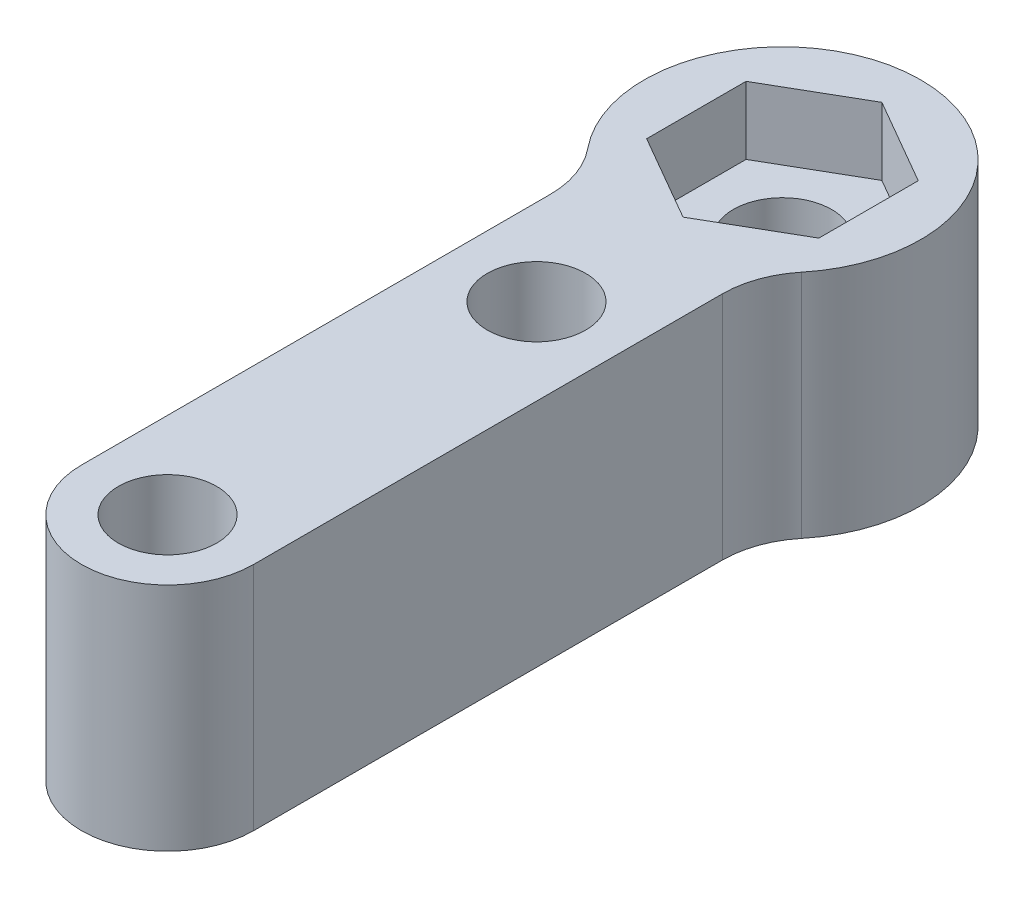
ISO-10303-21;
HEADER;
FILE_DESCRIPTION(('STEP AP214'),'2;1');
FILE_NAME('part.step','',(''),(''),'','','');
FILE_SCHEMA(('AUTOMOTIVE_DESIGN { 1 0 10303 214 1 1 1 1 }'));
ENDSEC;
DATA;
#1=APPLICATION_CONTEXT('core data for automotive mechanical design processes');
#2=APPLICATION_PROTOCOL_DEFINITION('international standard','automotive_design',2000,#1);
#3=PRODUCT_CONTEXT('',#1,'mechanical');
#4=PRODUCT('Part','Part','',(#3));
#5=PRODUCT_RELATED_PRODUCT_CATEGORY('part','',(#4));
#6=PRODUCT_DEFINITION_FORMATION('','',#4);
#7=PRODUCT_DEFINITION_CONTEXT('part definition',#1,'design');
#8=PRODUCT_DEFINITION('design','',#6,#7);
#9=PRODUCT_DEFINITION_SHAPE('','',#8);
#10=(LENGTH_UNIT() NAMED_UNIT(*) SI_UNIT(.MILLI.,.METRE.));
#11=(NAMED_UNIT(*) PLANE_ANGLE_UNIT() SI_UNIT($,.RADIAN.));
#12=(NAMED_UNIT(*) SI_UNIT($,.STERADIAN.) SOLID_ANGLE_UNIT());
#13=UNCERTAINTY_MEASURE_WITH_UNIT(LENGTH_MEASURE(1.E-05),#10,'distance_accuracy_value','');
#14=(GEOMETRIC_REPRESENTATION_CONTEXT(3) GLOBAL_UNCERTAINTY_ASSIGNED_CONTEXT((#13)) GLOBAL_UNIT_ASSIGNED_CONTEXT((#10,
#11,#12)) REPRESENTATION_CONTEXT('',''));
#15=CARTESIAN_POINT('',(0.,0.,0.));
#16=DIRECTION('',(0.,0.,1.));
#17=DIRECTION('',(1.,0.,0.));
#18=AXIS2_PLACEMENT_3D('',#15,#16,#17);
#19=CARTESIAN_POINT('',(0.,7.5,-20.));
#20=DIRECTION('',(0.,-1.,0.));
#21=DIRECTION('',(0.,0.,-1.));
#22=AXIS2_PLACEMENT_3D('',#19,#20,#21);
#23=CYLINDRICAL_SURFACE('',#22,1.6);
#24=CARTESIAN_POINT('',(0.,0.,-20.));
#25=DIRECTION('',(0.,1.,0.));
#26=DIRECTION('',(0.,0.,1.));
#27=AXIS2_PLACEMENT_3D('',#24,#25,#26);
#28=CIRCLE('',#27,1.6);
#29=CARTESIAN_POINT('',(0.,0.,-18.4));
#30=VERTEX_POINT('',#29);
#31=EDGE_CURVE('E178',#30,#30,#28,.T.);
#32=ORIENTED_EDGE('',*,*,#31,.F.);
#33=EDGE_LOOP('',(#32));
#34=FACE_BOUND('',#33,.T.);
#35=CARTESIAN_POINT('',(0.,5.3,-20.));
#36=DIRECTION('',(0.,1.,0.));
#37=DIRECTION('',(0.,0.,1.));
#38=AXIS2_PLACEMENT_3D('',#35,#36,#37);
#39=CIRCLE('',#38,1.6);
#40=CARTESIAN_POINT('',(0.,5.3,-18.4));
#41=VERTEX_POINT('',#40);
#42=EDGE_CURVE('E170',#41,#41,#39,.T.);
#43=ORIENTED_EDGE('',*,*,#42,.T.);
#44=EDGE_LOOP('',(#43));
#45=FACE_BOUND('',#44,.T.);
#46=ADVANCED_FACE('F32',(#34,#45),#23,.F.);
#47=CARTESIAN_POINT('',(0.,7.5,0.));
#48=DIRECTION('',(0.,1.,0.));
#49=DIRECTION('',(0.,0.,1.));
#50=AXIS2_PLACEMENT_3D('',#47,#48,#49);
#51=PLANE('',#50);
#52=DIRECTION('',(-0.866025403784439,0.,-0.5));
#53=VECTOR('',#52,1.);
#54=CARTESIAN_POINT('',(2.8,7.5,-21.616580753731));
#55=LINE('',#54,#53);
#56=CARTESIAN_POINT('',(2.8,7.5,-21.616580753731));
#57=VERTEX_POINT('',#56);
#58=CARTESIAN_POINT('',(0.,7.5,-23.2331615074619));
#59=VERTEX_POINT('',#58);
#60=EDGE_CURVE('E126',#57,#59,#55,.T.);
#61=ORIENTED_EDGE('',*,*,#60,.F.);
#62=DIRECTION('',(0.,0.,-1.));
#63=VECTOR('',#62,1.);
#64=CARTESIAN_POINT('',(2.8,7.5,-18.3834192462691));
#65=LINE('',#64,#63);
#66=CARTESIAN_POINT('',(2.8,7.5,-18.3834192462691));
#67=VERTEX_POINT('',#66);
#68=EDGE_CURVE('E144',#67,#57,#65,.T.);
#69=ORIENTED_EDGE('',*,*,#68,.F.);
#70=DIRECTION('',(0.866025403784438,0.,-0.5));
#71=VECTOR('',#70,1.);
#72=CARTESIAN_POINT('',(0.,7.5,-16.7668384925381));
#73=LINE('',#72,#71);
#74=CARTESIAN_POINT('',(0.,7.5,-16.7668384925381));
#75=VERTEX_POINT('',#74);
#76=EDGE_CURVE('E147',#75,#67,#73,.T.);
#77=ORIENTED_EDGE('',*,*,#76,.F.);
#78=DIRECTION('',(0.866025403784438,0.,0.500000000000001));
#79=VECTOR('',#78,1.);
#80=CARTESIAN_POINT('',(-2.8,7.5,-18.3834192462691));
#81=LINE('',#80,#79);
#82=CARTESIAN_POINT('',(-2.8,7.5,-18.3834192462691));
#83=VERTEX_POINT('',#82);
#84=EDGE_CURVE('E163',#83,#75,#81,.T.);
#85=ORIENTED_EDGE('',*,*,#84,.F.);
#86=DIRECTION('',(0.,0.,1.));
#87=VECTOR('',#86,1.);
#88=CARTESIAN_POINT('',(-2.8,7.5,-21.616580753731));
#89=LINE('',#88,#87);
#90=CARTESIAN_POINT('',(-2.8,7.5,-21.616580753731));
#91=VERTEX_POINT('',#90);
#92=EDGE_CURVE('E160',#91,#83,#89,.T.);
#93=ORIENTED_EDGE('',*,*,#92,.F.);
#94=DIRECTION('',(-0.866025403784439,0.,0.5));
#95=VECTOR('',#94,1.);
#96=CARTESIAN_POINT('',(0.,7.5,-23.2331615074619));
#97=LINE('',#96,#95);
#98=EDGE_CURVE('E158',#59,#91,#97,.T.);
#99=ORIENTED_EDGE('',*,*,#98,.F.);
#100=EDGE_LOOP('',(#61,#69,#77,#85,#93,#99));
#101=FACE_BOUND('',#100,.T.);
#102=CARTESIAN_POINT('',(0.,7.5,-12.));
#103=DIRECTION('',(0.,1.,0.));
#104=DIRECTION('',(0.,0.,1.));
#105=AXIS2_PLACEMENT_3D('',#102,#103,#104);
#106=CIRCLE('',#105,1.6);
#107=CARTESIAN_POINT('',(0.,7.5,-10.4));
#108=VERTEX_POINT('',#107);
#109=EDGE_CURVE('E182',#108,#108,#106,.T.);
#110=ORIENTED_EDGE('',*,*,#109,.F.);
#111=EDGE_LOOP('',(#110));
#112=FACE_BOUND('',#111,.T.);
#113=CARTESIAN_POINT('',(0.,7.5,0.));
#114=DIRECTION('',(0.,1.,0.));
#115=DIRECTION('',(0.,0.,1.));
#116=AXIS2_PLACEMENT_3D('',#113,#114,#115);
#117=CIRCLE('',#116,2.8);
#118=CARTESIAN_POINT('',(-2.8,7.5,0.));
#119=VERTEX_POINT('',#118);
#120=CARTESIAN_POINT('',(2.8,7.5,0.));
#121=VERTEX_POINT('',#120);
#122=EDGE_CURVE('E194',#119,#121,#117,.T.);
#123=ORIENTED_EDGE('',*,*,#122,.T.);
#124=DIRECTION('',(0.,0.,-1.));
#125=VECTOR('',#124,1.);
#126=CARTESIAN_POINT('',(2.8,7.5,0.));
#127=LINE('',#126,#125);
#128=CARTESIAN_POINT('',(2.8,7.5,-15.2450026288125));
#129=VERTEX_POINT('',#128);
#130=EDGE_CURVE('E197',#121,#129,#127,.T.);
#131=ORIENTED_EDGE('',*,*,#130,.T.);
#132=CARTESIAN_POINT('',(5.8,7.5,-15.2450026288125));
#133=DIRECTION('',(0.,1.,0.));
#134=DIRECTION('',(0.,0.,1.));
#135=AXIS2_PLACEMENT_3D('',#132,#133,#134);
#136=CIRCLE('',#135,3.);
#137=CARTESIAN_POINT('',(3.48,7.5,-17.1470015772875));
#138=VERTEX_POINT('',#137);
#139=EDGE_CURVE('E11',#129,#138,#136,.F.);
#140=ORIENTED_EDGE('',*,*,#139,.T.);
#141=CARTESIAN_POINT('',(0.,7.5,-20.));
#142=DIRECTION('',(0.,1.,0.));
#143=DIRECTION('',(0.,0.,1.));
#144=AXIS2_PLACEMENT_3D('',#141,#142,#143);
#145=CIRCLE('',#144,4.5);
#146=CARTESIAN_POINT('',(-3.48,7.5,-17.1470015772875));
#147=VERTEX_POINT('',#146);
#148=EDGE_CURVE('E200',#138,#147,#145,.T.);
#149=ORIENTED_EDGE('',*,*,#148,.T.);
#150=CARTESIAN_POINT('',(-5.8,7.5,-15.2450026288125));
#151=DIRECTION('',(0.,1.,0.));
#152=DIRECTION('',(0.,0.,1.));
#153=AXIS2_PLACEMENT_3D('',#150,#151,#152);
#154=CIRCLE('',#153,3.);
#155=CARTESIAN_POINT('',(-2.8,7.5,-15.2450026288125));
#156=VERTEX_POINT('',#155);
#157=EDGE_CURVE('E232',#147,#156,#154,.F.);
#158=ORIENTED_EDGE('',*,*,#157,.T.);
#159=DIRECTION('',(0.,0.,1.));
#160=VECTOR('',#159,1.);
#161=CARTESIAN_POINT('',(-2.8,7.5,0.));
#162=LINE('',#161,#160);
#163=EDGE_CURVE('E203',#156,#119,#162,.T.);
#164=ORIENTED_EDGE('',*,*,#163,.T.);
#165=EDGE_LOOP('',(#123,#131,#140,#149,#158,#164));
#166=FACE_BOUND('',#165,.T.);
#167=CARTESIAN_POINT('',(0.,7.5,0.));
#168=DIRECTION('',(0.,1.,0.));
#169=DIRECTION('',(0.,0.,1.));
#170=AXIS2_PLACEMENT_3D('',#167,#168,#169);
#171=CIRCLE('',#170,1.6);
#172=CARTESIAN_POINT('',(0.,7.5,1.6));
#173=VERTEX_POINT('',#172);
#174=EDGE_CURVE('E188',#173,#173,#171,.T.);
#175=ORIENTED_EDGE('',*,*,#174,.F.);
#176=EDGE_LOOP('',(#175));
#177=FACE_BOUND('',#176,.T.);
#178=ADVANCED_FACE('F236',(#101,#112,#166,#177),#51,.T.);
#179=CARTESIAN_POINT('',(0.,0.,0.));
#180=DIRECTION('',(0.,1.,0.));
#181=DIRECTION('',(0.,0.,1.));
#182=AXIS2_PLACEMENT_3D('',#179,#180,#181);
#183=PLANE('',#182);
#184=CARTESIAN_POINT('',(0.,0.,-12.));
#185=DIRECTION('',(0.,1.,0.));
#186=DIRECTION('',(0.,0.,1.));
#187=AXIS2_PLACEMENT_3D('',#184,#185,#186);
#188=CIRCLE('',#187,1.6);
#189=CARTESIAN_POINT('',(0.,0.,-10.4));
#190=VERTEX_POINT('',#189);
#191=EDGE_CURVE('E181',#190,#190,#188,.T.);
#192=ORIENTED_EDGE('',*,*,#191,.T.);
#193=EDGE_LOOP('',(#192));
#194=FACE_BOUND('',#193,.T.);
#195=CARTESIAN_POINT('',(0.,0.,0.));
#196=DIRECTION('',(0.,1.,0.));
#197=DIRECTION('',(0.,0.,1.));
#198=AXIS2_PLACEMENT_3D('',#195,#196,#197);
#199=CIRCLE('',#198,2.8);
#200=CARTESIAN_POINT('',(-2.8,0.,0.));
#201=VERTEX_POINT('',#200);
#202=CARTESIAN_POINT('',(2.8,0.,0.));
#203=VERTEX_POINT('',#202);
#204=EDGE_CURVE('E191',#201,#203,#199,.T.);
#205=ORIENTED_EDGE('',*,*,#204,.F.);
#206=DIRECTION('',(0.,0.,1.));
#207=VECTOR('',#206,1.);
#208=CARTESIAN_POINT('',(-2.8,0.,0.));
#209=LINE('',#208,#207);
#210=CARTESIAN_POINT('',(-2.8,0.,-15.2450026288125));
#211=VERTEX_POINT('',#210);
#212=EDGE_CURVE('E198',#211,#201,#209,.T.);
#213=ORIENTED_EDGE('',*,*,#212,.F.);
#214=CARTESIAN_POINT('',(-5.8,0.,-15.2450026288125));
#215=DIRECTION('',(0.,1.,0.));
#216=DIRECTION('',(0.,0.,1.));
#217=AXIS2_PLACEMENT_3D('',#214,#215,#216);
#218=CIRCLE('',#217,3.);
#219=CARTESIAN_POINT('',(-3.48,0.,-17.1470015772875));
#220=VERTEX_POINT('',#219);
#221=EDGE_CURVE('E230',#211,#220,#218,.T.);
#222=ORIENTED_EDGE('',*,*,#221,.T.);
#223=CARTESIAN_POINT('',(0.,0.,-20.));
#224=DIRECTION('',(0.,1.,0.));
#225=DIRECTION('',(0.,0.,1.));
#226=AXIS2_PLACEMENT_3D('',#223,#224,#225);
#227=CIRCLE('',#226,4.5);
#228=CARTESIAN_POINT('',(3.48,0.,-17.1470015772875));
#229=VERTEX_POINT('',#228);
#230=EDGE_CURVE('E210',#229,#220,#227,.T.);
#231=ORIENTED_EDGE('',*,*,#230,.F.);
#232=CARTESIAN_POINT('',(5.8,0.,-15.2450026288125));
#233=DIRECTION('',(0.,1.,0.));
#234=DIRECTION('',(0.,0.,1.));
#235=AXIS2_PLACEMENT_3D('',#232,#233,#234);
#236=CIRCLE('',#235,3.);
#237=CARTESIAN_POINT('',(2.8,0.,-15.2450026288125));
#238=VERTEX_POINT('',#237);
#239=EDGE_CURVE('E40',#229,#238,#236,.T.);
#240=ORIENTED_EDGE('',*,*,#239,.T.);
#241=DIRECTION('',(0.,0.,-1.));
#242=VECTOR('',#241,1.);
#243=CARTESIAN_POINT('',(2.8,0.,0.));
#244=LINE('',#243,#242);
#245=EDGE_CURVE('E208',#203,#238,#244,.T.);
#246=ORIENTED_EDGE('',*,*,#245,.F.);
#247=EDGE_LOOP('',(#205,#213,#222,#231,#240,#246));
#248=FACE_BOUND('',#247,.T.);
#249=CARTESIAN_POINT('',(0.,0.,0.));
#250=DIRECTION('',(0.,1.,0.));
#251=DIRECTION('',(0.,0.,1.));
#252=AXIS2_PLACEMENT_3D('',#249,#250,#251);
#253=CIRCLE('',#252,1.6);
#254=CARTESIAN_POINT('',(0.,0.,1.6));
#255=VERTEX_POINT('',#254);
#256=EDGE_CURVE('E185',#255,#255,#253,.T.);
#257=ORIENTED_EDGE('',*,*,#256,.T.);
#258=EDGE_LOOP('',(#257));
#259=FACE_BOUND('',#258,.T.);
#260=ORIENTED_EDGE('',*,*,#31,.T.);
#261=EDGE_LOOP('',(#260));
#262=FACE_BOUND('',#261,.T.);
#263=ADVANCED_FACE('F249',(#194,#248,#259,#262),#183,.F.);
#264=CARTESIAN_POINT('',(0.,7.5,0.));
#265=DIRECTION('',(0.,-1.,0.));
#266=DIRECTION('',(0.,0.,-1.));
#267=AXIS2_PLACEMENT_3D('',#264,#265,#266);
#268=CYLINDRICAL_SURFACE('',#267,2.8);
#269=ORIENTED_EDGE('',*,*,#204,.T.);
#270=DIRECTION('',(0.,-1.,0.));
#271=VECTOR('',#270,1.);
#272=CARTESIAN_POINT('',(2.8,7.5,0.));
#273=LINE('',#272,#271);
#274=EDGE_CURVE('E216',#121,#203,#273,.T.);
#275=ORIENTED_EDGE('',*,*,#274,.F.);
#276=ORIENTED_EDGE('',*,*,#122,.F.);
#277=DIRECTION('',(0.,-1.,0.));
#278=VECTOR('',#277,1.);
#279=CARTESIAN_POINT('',(-2.8,7.5,0.));
#280=LINE('',#279,#278);
#281=EDGE_CURVE('E205',#119,#201,#280,.T.);
#282=ORIENTED_EDGE('',*,*,#281,.T.);
#283=EDGE_LOOP('',(#269,#275,#276,#282));
#284=FACE_BOUND('',#283,.T.);
#285=ADVANCED_FACE('F259',(#284),#268,.T.);
#286=CARTESIAN_POINT('',(2.8,7.5,0.));
#287=DIRECTION('',(-1.,0.,0.));
#288=DIRECTION('',(0.,0.,1.));
#289=AXIS2_PLACEMENT_3D('',#286,#287,#288);
#290=PLANE('',#289);
#291=ORIENTED_EDGE('',*,*,#245,.T.);
#292=DIRECTION('',(0.,1.,0.));
#293=VECTOR('',#292,1.);
#294=CARTESIAN_POINT('',(2.8,7.5,-15.2450026288125));
#295=LINE('',#294,#293);
#296=EDGE_CURVE('E47',#238,#129,#295,.T.);
#297=ORIENTED_EDGE('',*,*,#296,.T.);
#298=ORIENTED_EDGE('',*,*,#130,.F.);
#299=ORIENTED_EDGE('',*,*,#274,.T.);
#300=EDGE_LOOP('',(#291,#297,#298,#299));
#301=FACE_BOUND('',#300,.T.);
#302=ADVANCED_FACE('F257',(#301),#290,.F.);
#303=CARTESIAN_POINT('',(0.,7.5,-20.));
#304=DIRECTION('',(0.,-1.,0.));
#305=DIRECTION('',(0.,0.,-1.));
#306=AXIS2_PLACEMENT_3D('',#303,#304,#305);
#307=CYLINDRICAL_SURFACE('',#306,4.5);
#308=ORIENTED_EDGE('',*,*,#230,.T.);
#309=DIRECTION('',(0.,-1.,0.));
#310=VECTOR('',#309,1.);
#311=CARTESIAN_POINT('',(-3.48,7.5,-17.1470015772875));
#312=LINE('',#311,#310);
#313=EDGE_CURVE('E227',#220,#147,#312,.F.);
#314=ORIENTED_EDGE('',*,*,#313,.T.);
#315=ORIENTED_EDGE('',*,*,#148,.F.);
#316=DIRECTION('',(0.,-1.,0.));
#317=VECTOR('',#316,1.);
#318=CARTESIAN_POINT('',(3.48,7.5,-17.1470015772875));
#319=LINE('',#318,#317);
#320=EDGE_CURVE('E224',#138,#229,#319,.T.);
#321=ORIENTED_EDGE('',*,*,#320,.T.);
#322=EDGE_LOOP('',(#308,#314,#315,#321));
#323=FACE_BOUND('',#322,.T.);
#324=ADVANCED_FACE('F252',(#323),#307,.T.);
#325=CARTESIAN_POINT('',(-2.8,7.5,0.));
#326=DIRECTION('',(1.,0.,0.));
#327=DIRECTION('',(0.,0.,-1.));
#328=AXIS2_PLACEMENT_3D('',#325,#326,#327);
#329=PLANE('',#328);
#330=ORIENTED_EDGE('',*,*,#163,.F.);
#331=DIRECTION('',(0.,1.,0.));
#332=VECTOR('',#331,1.);
#333=CARTESIAN_POINT('',(-2.8,0.,-15.2450026288125));
#334=LINE('',#333,#332);
#335=EDGE_CURVE('E219',#156,#211,#334,.F.);
#336=ORIENTED_EDGE('',*,*,#335,.T.);
#337=ORIENTED_EDGE('',*,*,#212,.T.);
#338=ORIENTED_EDGE('',*,*,#281,.F.);
#339=EDGE_LOOP('',(#330,#336,#337,#338));
#340=FACE_BOUND('',#339,.T.);
#341=ADVANCED_FACE('F244',(#340),#329,.F.);
#342=CARTESIAN_POINT('',(0.,7.5,0.));
#343=DIRECTION('',(0.,-1.,0.));
#344=DIRECTION('',(0.,0.,-1.));
#345=AXIS2_PLACEMENT_3D('',#342,#343,#344);
#346=CYLINDRICAL_SURFACE('',#345,1.6);
#347=ORIENTED_EDGE('',*,*,#174,.T.);
#348=EDGE_LOOP('',(#347));
#349=FACE_BOUND('',#348,.T.);
#350=ORIENTED_EDGE('',*,*,#256,.F.);
#351=EDGE_LOOP('',(#350));
#352=FACE_BOUND('',#351,.T.);
#353=ADVANCED_FACE('F285',(#349,#352),#346,.F.);
#354=CARTESIAN_POINT('',(0.,7.5,-12.));
#355=DIRECTION('',(0.,-1.,0.));
#356=DIRECTION('',(0.,0.,-1.));
#357=AXIS2_PLACEMENT_3D('',#354,#355,#356);
#358=CYLINDRICAL_SURFACE('',#357,1.6);
#359=ORIENTED_EDGE('',*,*,#109,.T.);
#360=EDGE_LOOP('',(#359));
#361=FACE_BOUND('',#360,.T.);
#362=ORIENTED_EDGE('',*,*,#191,.F.);
#363=EDGE_LOOP('',(#362));
#364=FACE_BOUND('',#363,.T.);
#365=ADVANCED_FACE('F282',(#361,#364),#358,.F.);
#366=CARTESIAN_POINT('',(2.8,5.3,-21.616580753731));
#367=DIRECTION('',(0.5,0.,-0.866025403784439));
#368=DIRECTION('',(-0.866025403784439,0.,-0.5));
#369=AXIS2_PLACEMENT_3D('',#366,#367,#368);
#370=PLANE('',#369);
#371=ORIENTED_EDGE('',*,*,#60,.T.);
#372=DIRECTION('',(0.,1.,0.));
#373=VECTOR('',#372,1.);
#374=CARTESIAN_POINT('',(0.,5.3,-23.2331615074619));
#375=LINE('',#374,#373);
#376=CARTESIAN_POINT('',(0.,5.3,-23.2331615074619));
#377=VERTEX_POINT('',#376);
#378=EDGE_CURVE('E119',#377,#59,#375,.T.);
#379=ORIENTED_EDGE('',*,*,#378,.F.);
#380=DIRECTION('',(-0.866025403784439,0.,-0.5));
#381=VECTOR('',#380,1.);
#382=CARTESIAN_POINT('',(2.8,5.3,-21.616580753731));
#383=LINE('',#382,#381);
#384=CARTESIAN_POINT('',(2.8,5.3,-21.616580753731));
#385=VERTEX_POINT('',#384);
#386=EDGE_CURVE('E123',#385,#377,#383,.T.);
#387=ORIENTED_EDGE('',*,*,#386,.F.);
#388=DIRECTION('',(0.,1.,0.));
#389=VECTOR('',#388,1.);
#390=CARTESIAN_POINT('',(2.8,5.3,-21.616580753731));
#391=LINE('',#390,#389);
#392=EDGE_CURVE('E168',#385,#57,#391,.T.);
#393=ORIENTED_EDGE('',*,*,#392,.T.);
#394=EDGE_LOOP('',(#371,#379,#387,#393));
#395=FACE_BOUND('',#394,.T.);
#396=ADVANCED_FACE('F121',(#395),#370,.F.);
#397=CARTESIAN_POINT('',(2.8,5.3,-18.3834192462691));
#398=DIRECTION('',(1.,0.,0.));
#399=DIRECTION('',(0.,0.,-1.));
#400=AXIS2_PLACEMENT_3D('',#397,#398,#399);
#401=PLANE('',#400);
#402=ORIENTED_EDGE('',*,*,#68,.T.);
#403=ORIENTED_EDGE('',*,*,#392,.F.);
#404=DIRECTION('',(0.,0.,-1.));
#405=VECTOR('',#404,1.);
#406=CARTESIAN_POINT('',(2.8,5.3,-18.3834192462691));
#407=LINE('',#406,#405);
#408=CARTESIAN_POINT('',(2.8,5.3,-18.3834192462691));
#409=VERTEX_POINT('',#408);
#410=EDGE_CURVE('E131',#409,#385,#407,.T.);
#411=ORIENTED_EDGE('',*,*,#410,.F.);
#412=DIRECTION('',(0.,1.,0.));
#413=VECTOR('',#412,1.);
#414=CARTESIAN_POINT('',(2.8,5.3,-18.3834192462691));
#415=LINE('',#414,#413);
#416=EDGE_CURVE('E171',#409,#67,#415,.T.);
#417=ORIENTED_EDGE('',*,*,#416,.T.);
#418=EDGE_LOOP('',(#402,#403,#411,#417));
#419=FACE_BOUND('',#418,.T.);
#420=ADVANCED_FACE('F316',(#419),#401,.F.);
#421=CARTESIAN_POINT('',(0.,5.3,-16.7668384925381));
#422=DIRECTION('',(0.5,0.,0.866025403784439));
#423=DIRECTION('',(0.866025403784438,0.,-0.5));
#424=AXIS2_PLACEMENT_3D('',#421,#422,#423);
#425=PLANE('',#424);
#426=ORIENTED_EDGE('',*,*,#76,.T.);
#427=ORIENTED_EDGE('',*,*,#416,.F.);
#428=DIRECTION('',(0.866025403784438,0.,-0.5));
#429=VECTOR('',#428,1.);
#430=CARTESIAN_POINT('',(0.,5.3,-16.7668384925381));
#431=LINE('',#430,#429);
#432=CARTESIAN_POINT('',(0.,5.3,-16.7668384925381));
#433=VERTEX_POINT('',#432);
#434=EDGE_CURVE('E154',#433,#409,#431,.T.);
#435=ORIENTED_EDGE('',*,*,#434,.F.);
#436=DIRECTION('',(0.,1.,0.));
#437=VECTOR('',#436,1.);
#438=CARTESIAN_POINT('',(0.,5.3,-16.7668384925381));
#439=LINE('',#438,#437);
#440=EDGE_CURVE('E173',#433,#75,#439,.T.);
#441=ORIENTED_EDGE('',*,*,#440,.T.);
#442=EDGE_LOOP('',(#426,#427,#435,#441));
#443=FACE_BOUND('',#442,.T.);
#444=ADVANCED_FACE('F322',(#443),#425,.F.);
#445=CARTESIAN_POINT('',(-2.8,5.3,-18.3834192462691));
#446=DIRECTION('',(-0.500000000000001,0.,0.866025403784438));
#447=DIRECTION('',(0.866025403784438,0.,0.500000000000001));
#448=AXIS2_PLACEMENT_3D('',#445,#446,#447);
#449=PLANE('',#448);
#450=ORIENTED_EDGE('',*,*,#84,.T.);
#451=ORIENTED_EDGE('',*,*,#440,.F.);
#452=DIRECTION('',(0.866025403784438,0.,0.500000000000001));
#453=VECTOR('',#452,1.);
#454=CARTESIAN_POINT('',(-2.8,5.3,-18.3834192462691));
#455=LINE('',#454,#453);
#456=CARTESIAN_POINT('',(-2.8,5.3,-18.3834192462691));
#457=VERTEX_POINT('',#456);
#458=EDGE_CURVE('E151',#457,#433,#455,.T.);
#459=ORIENTED_EDGE('',*,*,#458,.F.);
#460=DIRECTION('',(0.,1.,0.));
#461=VECTOR('',#460,1.);
#462=CARTESIAN_POINT('',(-2.8,5.3,-18.3834192462691));
#463=LINE('',#462,#461);
#464=EDGE_CURVE('E175',#457,#83,#463,.T.);
#465=ORIENTED_EDGE('',*,*,#464,.T.);
#466=EDGE_LOOP('',(#450,#451,#459,#465));
#467=FACE_BOUND('',#466,.T.);
#468=ADVANCED_FACE('F330',(#467),#449,.F.);
#469=CARTESIAN_POINT('',(-2.8,5.3,-21.616580753731));
#470=DIRECTION('',(-1.,0.,0.));
#471=DIRECTION('',(0.,0.,1.));
#472=AXIS2_PLACEMENT_3D('',#469,#470,#471);
#473=PLANE('',#472);
#474=ORIENTED_EDGE('',*,*,#92,.T.);
#475=ORIENTED_EDGE('',*,*,#464,.F.);
#476=DIRECTION('',(0.,0.,1.));
#477=VECTOR('',#476,1.);
#478=CARTESIAN_POINT('',(-2.8,5.3,-21.616580753731));
#479=LINE('',#478,#477);
#480=CARTESIAN_POINT('',(-2.8,5.3,-21.616580753731));
#481=VERTEX_POINT('',#480);
#482=EDGE_CURVE('E139',#481,#457,#479,.T.);
#483=ORIENTED_EDGE('',*,*,#482,.F.);
#484=DIRECTION('',(0.,1.,0.));
#485=VECTOR('',#484,1.);
#486=CARTESIAN_POINT('',(-2.8,5.3,-21.616580753731));
#487=LINE('',#486,#485);
#488=EDGE_CURVE('E130',#481,#91,#487,.T.);
#489=ORIENTED_EDGE('',*,*,#488,.T.);
#490=EDGE_LOOP('',(#474,#475,#483,#489));
#491=FACE_BOUND('',#490,.T.);
#492=ADVANCED_FACE('F338',(#491),#473,.F.);
#493=CARTESIAN_POINT('',(0.,5.3,-23.2331615074619));
#494=DIRECTION('',(-0.5,0.,-0.866025403784439));
#495=DIRECTION('',(-0.866025403784439,0.,0.5));
#496=AXIS2_PLACEMENT_3D('',#493,#494,#495);
#497=PLANE('',#496);
#498=ORIENTED_EDGE('',*,*,#98,.T.);
#499=ORIENTED_EDGE('',*,*,#488,.F.);
#500=DIRECTION('',(-0.866025403784439,0.,0.5));
#501=VECTOR('',#500,1.);
#502=CARTESIAN_POINT('',(0.,5.3,-23.2331615074619));
#503=LINE('',#502,#501);
#504=EDGE_CURVE('E134',#377,#481,#503,.T.);
#505=ORIENTED_EDGE('',*,*,#504,.F.);
#506=ORIENTED_EDGE('',*,*,#378,.T.);
#507=EDGE_LOOP('',(#498,#499,#505,#506));
#508=FACE_BOUND('',#507,.T.);
#509=ADVANCED_FACE('F135',(#508),#497,.F.);
#510=CARTESIAN_POINT('',(0.,5.3,0.));
#511=DIRECTION('',(0.,1.,0.));
#512=DIRECTION('',(0.,0.,1.));
#513=AXIS2_PLACEMENT_3D('',#510,#511,#512);
#514=PLANE('',#513);
#515=ORIENTED_EDGE('',*,*,#42,.F.);
#516=EDGE_LOOP('',(#515));
#517=FACE_BOUND('',#516,.T.);
#518=ORIENTED_EDGE('',*,*,#386,.T.);
#519=ORIENTED_EDGE('',*,*,#504,.T.);
#520=ORIENTED_EDGE('',*,*,#482,.T.);
#521=ORIENTED_EDGE('',*,*,#458,.T.);
#522=ORIENTED_EDGE('',*,*,#434,.T.);
#523=ORIENTED_EDGE('',*,*,#410,.T.);
#524=EDGE_LOOP('',(#518,#519,#520,#521,#522,#523));
#525=FACE_BOUND('',#524,.T.);
#526=ADVANCED_FACE('F141',(#517,#525),#514,.T.);
#527=CARTESIAN_POINT('',(-5.8,7.5,-15.2450026288125));
#528=DIRECTION('',(0.,-1.,0.));
#529=DIRECTION('',(0.,0.,-1.));
#530=AXIS2_PLACEMENT_3D('',#527,#528,#529);
#531=CYLINDRICAL_SURFACE('',#530,3.);
#532=ORIENTED_EDGE('',*,*,#157,.F.);
#533=ORIENTED_EDGE('',*,*,#313,.F.);
#534=ORIENTED_EDGE('',*,*,#221,.F.);
#535=ORIENTED_EDGE('',*,*,#335,.F.);
#536=EDGE_LOOP('',(#532,#533,#534,#535));
#537=FACE_BOUND('',#536,.T.);
#538=ADVANCED_FACE('F247',(#537),#531,.F.);
#539=CARTESIAN_POINT('',(5.8,7.5,-15.2450026288125));
#540=DIRECTION('',(0.,-1.,0.));
#541=DIRECTION('',(0.,0.,-1.));
#542=AXIS2_PLACEMENT_3D('',#539,#540,#541);
#543=CYLINDRICAL_SURFACE('',#542,3.);
#544=ORIENTED_EDGE('',*,*,#139,.F.);
#545=ORIENTED_EDGE('',*,*,#296,.F.);
#546=ORIENTED_EDGE('',*,*,#239,.F.);
#547=ORIENTED_EDGE('',*,*,#320,.F.);
#548=EDGE_LOOP('',(#544,#545,#546,#547));
#549=FACE_BOUND('',#548,.T.);
#550=ADVANCED_FACE('F34',(#549),#543,.F.);
#551=CLOSED_SHELL('',(#46,#178,#263,#285,#302,#324,#341,#353,#365,#396,#420,#444,#468,#492,#509,
#526,#538,#550));
#552=MANIFOLD_SOLID_BREP('B2',#551);
#553=ADVANCED_BREP_SHAPE_REPRESENTATION('',(#18,#552),#14);
#554=SHAPE_DEFINITION_REPRESENTATION(#9,#553);
ENDSEC;
END-ISO-10303-21;
